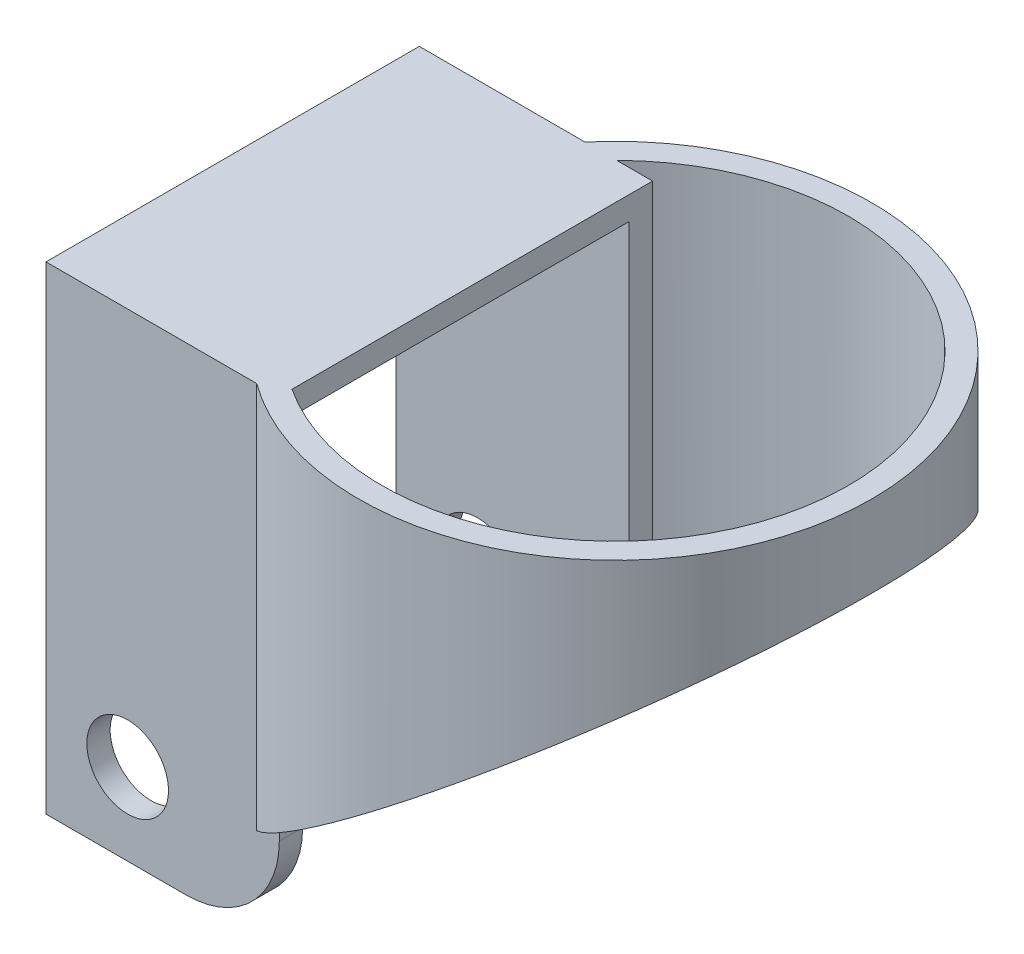
ISO-10303-21;
HEADER;
FILE_DESCRIPTION(('STEP AP214'),'2;1');
FILE_NAME('part.step','',(''),(''),'','','');
FILE_SCHEMA(('AUTOMOTIVE_DESIGN { 1 0 10303 214 1 1 1 1 }'));
ENDSEC;
DATA;
#1=APPLICATION_CONTEXT('core data for automotive mechanical design processes');
#2=APPLICATION_PROTOCOL_DEFINITION('international standard','automotive_design',2000,#1);
#3=PRODUCT_CONTEXT('',#1,'mechanical');
#4=PRODUCT('Part','Part','',(#3));
#5=PRODUCT_RELATED_PRODUCT_CATEGORY('part','',(#4));
#6=PRODUCT_DEFINITION_FORMATION('','',#4);
#7=PRODUCT_DEFINITION_CONTEXT('part definition',#1,'design');
#8=PRODUCT_DEFINITION('design','',#6,#7);
#9=PRODUCT_DEFINITION_SHAPE('','',#8);
#10=(LENGTH_UNIT() NAMED_UNIT(*) SI_UNIT(.MILLI.,.METRE.));
#11=(NAMED_UNIT(*) PLANE_ANGLE_UNIT() SI_UNIT($,.RADIAN.));
#12=(NAMED_UNIT(*) SI_UNIT($,.STERADIAN.) SOLID_ANGLE_UNIT());
#13=UNCERTAINTY_MEASURE_WITH_UNIT(LENGTH_MEASURE(1.E-05),#10,'distance_accuracy_value','');
#14=(GEOMETRIC_REPRESENTATION_CONTEXT(3) GLOBAL_UNCERTAINTY_ASSIGNED_CONTEXT((#13)) GLOBAL_UNIT_ASSIGNED_CONTEXT((#10,
#11,#12)) REPRESENTATION_CONTEXT('',''));
#15=CARTESIAN_POINT('',(0.,0.,0.));
#16=DIRECTION('',(0.,0.,1.));
#17=DIRECTION('',(1.,0.,0.));
#18=AXIS2_PLACEMENT_3D('',#15,#16,#17);
#19=CARTESIAN_POINT('',(0.,40.,0.));
#20=DIRECTION('',(0.,-1.,0.));
#21=DIRECTION('',(0.,0.,-1.));
#22=AXIS2_PLACEMENT_3D('',#19,#20,#21);
#23=CYLINDRICAL_SURFACE('',#22,22.);
#24=DIRECTION('',(0.,-1.,0.));
#25=VECTOR('',#24,1.);
#26=CARTESIAN_POINT('',(-16.7967752148894,40.,-14.2080379497127));
#27=LINE('',#26,#25);
#28=CARTESIAN_POINT('',(-16.7967752148894,40.,-14.2080379497127));
#29=VERTEX_POINT('',#28);
#30=CARTESIAN_POINT('',(-16.7967752148894,3.90241858883297,-14.2080379497128));
#31=VERTEX_POINT('',#30);
#32=EDGE_CURVE('E212',#29,#31,#27,.T.);
#33=ORIENTED_EDGE('',*,*,#32,.F.);
#34=CARTESIAN_POINT('',(0.,40.,0.));
#35=DIRECTION('',(0.,1.,0.));
#36=DIRECTION('',(0.,0.,1.));
#37=AXIS2_PLACEMENT_3D('',#34,#35,#36);
#38=CIRCLE('',#37,22.);
#39=CARTESIAN_POINT('',(-12.9400960738759,40.,17.7919620502873));
#40=VERTEX_POINT('',#39);
#41=EDGE_CURVE('E220',#40,#29,#38,.T.);
#42=ORIENTED_EDGE('',*,*,#41,.F.);
#43=DIRECTION('',(0.,-1.,0.));
#44=VECTOR('',#43,1.);
#45=CARTESIAN_POINT('',(-12.9400960738759,40.,17.7919620502873));
#46=LINE('',#45,#44);
#47=CARTESIAN_POINT('',(-12.9400960738759,6.79492794459309,17.7919620502873));
#48=VERTEX_POINT('',#47);
#49=EDGE_CURVE('E208',#48,#40,#46,.F.);
#50=ORIENTED_EDGE('',*,*,#49,.F.);
#51=CARTESIAN_POINT('',(0.,16.5,0.));
#52=DIRECTION('',(-0.6,0.8,0.));
#53=DIRECTION('',(-0.8,-0.6,0.));
#54=AXIS2_PLACEMENT_3D('',#51,#52,#53);
#55=ELLIPSE('',#54,27.5,22.);
#56=EDGE_CURVE('E216',#48,#31,#55,.T.);
#57=ORIENTED_EDGE('',*,*,#56,.T.);
#58=EDGE_LOOP('',(#33,#42,#50,#57));
#59=FACE_BOUND('',#58,.T.);
#60=ADVANCED_FACE('F32',(#59),#23,.T.);
#61=CARTESIAN_POINT('',(0.,40.,0.));
#62=DIRECTION('',(0.,-1.,0.));
#63=DIRECTION('',(0.,0.,-1.));
#64=AXIS2_PLACEMENT_3D('',#61,#62,#63);
#65=CYLINDRICAL_SURFACE('',#64,20.);
#66=CARTESIAN_POINT('',(0.,40.,0.));
#67=DIRECTION('',(0.,1.,0.));
#68=DIRECTION('',(0.,0.,1.));
#69=AXIS2_PLACEMENT_3D('',#66,#67,#68);
#70=CIRCLE('',#69,20.);
#71=CARTESIAN_POINT('',(-11.,40.,16.7032930884901));
#72=VERTEX_POINT('',#71);
#73=CARTESIAN_POINT('',(-14.0759247518421,40.,-14.2080379497127));
#74=VERTEX_POINT('',#73);
#75=EDGE_CURVE('E156',#72,#74,#70,.T.);
#76=ORIENTED_EDGE('',*,*,#75,.T.);
#77=DIRECTION('',(0.,-1.,0.));
#78=VECTOR('',#77,1.);
#79=CARTESIAN_POINT('',(-14.0759247518421,40.,-14.2080379497127));
#80=LINE('',#79,#78);
#81=CARTESIAN_POINT('',(-14.0759247518421,5.9430564361184,-14.2080379497128));
#82=VERTEX_POINT('',#81);
#83=EDGE_CURVE('E148',#74,#82,#80,.T.);
#84=ORIENTED_EDGE('',*,*,#83,.T.);
#85=CARTESIAN_POINT('',(0.,16.5,0.));
#86=DIRECTION('',(-0.6,0.8,0.));
#87=DIRECTION('',(-0.8,-0.6,0.));
#88=AXIS2_PLACEMENT_3D('',#85,#86,#87);
#89=ELLIPSE('',#88,25.,20.);
#90=CARTESIAN_POINT('',(-11.,8.25,16.7032930884901));
#91=VERTEX_POINT('',#90);
#92=EDGE_CURVE('E215',#91,#82,#89,.T.);
#93=ORIENTED_EDGE('',*,*,#92,.F.);
#94=DIRECTION('',(0.,-1.,0.));
#95=VECTOR('',#94,1.);
#96=CARTESIAN_POINT('',(-11.,40.,16.7032930884901));
#97=LINE('',#96,#95);
#98=EDGE_CURVE('E206',#91,#72,#97,.F.);
#99=ORIENTED_EDGE('',*,*,#98,.T.);
#100=EDGE_LOOP('',(#76,#84,#93,#99));
#101=FACE_BOUND('',#100,.T.);
#102=ADVANCED_FACE('F286',(#101),#65,.F.);
#103=CARTESIAN_POINT('',(22.,33.,-22.));
#104=DIRECTION('',(-0.6,0.8,0.));
#105=DIRECTION('',(-0.8,-0.6,0.));
#106=AXIS2_PLACEMENT_3D('',#103,#104,#105);
#107=PLANE('',#106);
#108=DIRECTION('',(0.8,0.6,0.));
#109=VECTOR('',#108,1.);
#110=CARTESIAN_POINT('',(22.,33.,-14.2080379497127));
#111=LINE('',#110,#109);
#112=EDGE_CURVE('E231',#31,#82,#111,.T.);
#113=ORIENTED_EDGE('',*,*,#112,.F.);
#114=ORIENTED_EDGE('',*,*,#56,.F.);
#115=DIRECTION('',(-0.8,-0.6,0.));
#116=VECTOR('',#115,1.);
#117=CARTESIAN_POINT('',(22.,33.,17.7919620502873));
#118=LINE('',#117,#116);
#119=CARTESIAN_POINT('',(-11.,8.25,17.7919620502873));
#120=VERTEX_POINT('',#119);
#121=EDGE_CURVE('E228',#120,#48,#118,.T.);
#122=ORIENTED_EDGE('',*,*,#121,.F.);
#123=DIRECTION('',(0.,0.,1.));
#124=VECTOR('',#123,1.);
#125=CARTESIAN_POINT('',(-11.,8.25,-22.));
#126=LINE('',#125,#124);
#127=EDGE_CURVE('E223',#91,#120,#126,.T.);
#128=ORIENTED_EDGE('',*,*,#127,.F.);
#129=ORIENTED_EDGE('',*,*,#92,.T.);
#130=EDGE_LOOP('',(#113,#114,#122,#128,#129));
#131=FACE_BOUND('',#130,.T.);
#132=ADVANCED_FACE('F292',(#131),#107,.F.);
#133=CARTESIAN_POINT('',(0.,40.,0.));
#134=DIRECTION('',(0.,1.,0.));
#135=DIRECTION('',(0.,0.,1.));
#136=AXIS2_PLACEMENT_3D('',#133,#134,#135);
#137=PLANE('',#136);
#138=DIRECTION('',(-1.,0.,0.));
#139=VECTOR('',#138,1.);
#140=CARTESIAN_POINT('',(-11.,40.,-14.2080379497127));
#141=LINE('',#140,#139);
#142=CARTESIAN_POINT('',(-11.,40.,-14.2080379497127));
#143=VERTEX_POINT('',#142);
#144=EDGE_CURVE('E145',#143,#74,#141,.T.);
#145=ORIENTED_EDGE('',*,*,#144,.T.);
#146=ORIENTED_EDGE('',*,*,#75,.F.);
#147=DIRECTION('',(0.,0.,1.));
#148=VECTOR('',#147,1.);
#149=CARTESIAN_POINT('',(-11.,40.,-14.2080379497127));
#150=LINE('',#149,#148);
#151=EDGE_CURVE('E137',#143,#72,#150,.T.);
#152=ORIENTED_EDGE('',*,*,#151,.F.);
#153=EDGE_LOOP('',(#145,#146,#152));
#154=FACE_BOUND('',#153,.T.);
#155=DIRECTION('',(-1.,0.,0.));
#156=VECTOR('',#155,1.);
#157=CARTESIAN_POINT('',(-11.,40.,17.7919620502873));
#158=LINE('',#157,#156);
#159=CARTESIAN_POINT('',(-31.,40.,17.7919620502873));
#160=VERTEX_POINT('',#159);
#161=EDGE_CURVE('E203',#40,#160,#158,.T.);
#162=ORIENTED_EDGE('',*,*,#161,.F.);
#163=ORIENTED_EDGE('',*,*,#41,.T.);
#164=CARTESIAN_POINT('',(-31.,40.,-14.2080379497127));
#165=VERTEX_POINT('',#164);
#166=EDGE_CURVE('E152',#29,#165,#141,.T.);
#167=ORIENTED_EDGE('',*,*,#166,.T.);
#168=DIRECTION('',(0.,0.,1.));
#169=VECTOR('',#168,1.);
#170=CARTESIAN_POINT('',(-31.,40.,-14.2080379497127));
#171=LINE('',#170,#169);
#172=EDGE_CURVE('E177',#165,#160,#171,.T.);
#173=ORIENTED_EDGE('',*,*,#172,.T.);
#174=EDGE_LOOP('',(#162,#163,#167,#173));
#175=FACE_BOUND('',#174,.T.);
#176=ADVANCED_FACE('F154',(#154,#175),#137,.T.);
#177=CARTESIAN_POINT('',(-11.,38.,-12.2080379497127));
#178=DIRECTION('',(0.,1.,0.));
#179=DIRECTION('',(0.,0.,1.));
#180=AXIS2_PLACEMENT_3D('',#177,#178,#179);
#181=PLANE('',#180);
#182=DIRECTION('',(-1.,0.,0.));
#183=VECTOR('',#182,1.);
#184=CARTESIAN_POINT('',(-11.,38.,15.7919620502873));
#185=LINE('',#184,#183);
#186=CARTESIAN_POINT('',(-11.,38.,15.7919620502873));
#187=VERTEX_POINT('',#186);
#188=CARTESIAN_POINT('',(-31.,38.,15.7919620502873));
#189=VERTEX_POINT('',#188);
#190=EDGE_CURVE('E197',#187,#189,#185,.T.);
#191=ORIENTED_EDGE('',*,*,#190,.T.);
#192=DIRECTION('',(0.,0.,-1.));
#193=VECTOR('',#192,1.);
#194=CARTESIAN_POINT('',(-31.,38.,-12.2080379497127));
#195=LINE('',#194,#193);
#196=CARTESIAN_POINT('',(-31.,38.,-12.2080379497127));
#197=VERTEX_POINT('',#196);
#198=EDGE_CURVE('E189',#189,#197,#195,.T.);
#199=ORIENTED_EDGE('',*,*,#198,.T.);
#200=DIRECTION('',(-1.,0.,0.));
#201=VECTOR('',#200,1.);
#202=CARTESIAN_POINT('',(-11.,38.,-12.2080379497127));
#203=LINE('',#202,#201);
#204=CARTESIAN_POINT('',(-11.,38.,-12.2080379497127));
#205=VERTEX_POINT('',#204);
#206=EDGE_CURVE('E195',#205,#197,#203,.T.);
#207=ORIENTED_EDGE('',*,*,#206,.F.);
#208=DIRECTION('',(0.,0.,-1.));
#209=VECTOR('',#208,1.);
#210=CARTESIAN_POINT('',(-11.,38.,-12.2080379497127));
#211=LINE('',#210,#209);
#212=EDGE_CURVE('E164',#187,#205,#211,.T.);
#213=ORIENTED_EDGE('',*,*,#212,.F.);
#214=EDGE_LOOP('',(#191,#199,#207,#213));
#215=FACE_BOUND('',#214,.T.);
#216=ADVANCED_FACE('F274',(#215),#181,.F.);
#217=CARTESIAN_POINT('',(-11.,40.,-14.2080379497127));
#218=DIRECTION('',(0.,0.,1.));
#219=DIRECTION('',(0.,-1.,0.));
#220=AXIS2_PLACEMENT_3D('',#217,#218,#219);
#221=PLANE('',#220);
#222=CARTESIAN_POINT('',(-24.,6.,-14.2080379497128));
#223=DIRECTION('',(0.,0.,1.));
#224=DIRECTION('',(0.,-1.,0.));
#225=AXIS2_PLACEMENT_3D('',#222,#223,#224);
#226=CIRCLE('',#225,3.5);
#227=CARTESIAN_POINT('',(-24.,2.5,-14.2080379497128));
#228=VERTEX_POINT('',#227);
#229=EDGE_CURVE('E174',#228,#228,#226,.T.);
#230=ORIENTED_EDGE('',*,*,#229,.T.);
#231=EDGE_LOOP('',(#230));
#232=FACE_BOUND('',#231,.T.);
#233=DIRECTION('',(0.,1.,0.));
#234=VECTOR('',#233,1.);
#235=CARTESIAN_POINT('',(-11.,40.,-14.2080379497127));
#236=LINE('',#235,#234);
#237=CARTESIAN_POINT('',(-11.,7.,-14.2080379497128));
#238=VERTEX_POINT('',#237);
#239=EDGE_CURVE('E131',#238,#143,#236,.T.);
#240=ORIENTED_EDGE('',*,*,#239,.F.);
#241=CARTESIAN_POINT('',(-19.,7.,-14.2080379497128));
#242=DIRECTION('',(0.,0.,1.));
#243=DIRECTION('',(0.,-1.,0.));
#244=AXIS2_PLACEMENT_3D('',#241,#242,#243);
#245=CIRCLE('',#244,8.);
#246=CARTESIAN_POINT('',(-19.,-1.,-14.2080379497128));
#247=VERTEX_POINT('',#246);
#248=EDGE_CURVE('E54',#238,#247,#245,.F.);
#249=ORIENTED_EDGE('',*,*,#248,.T.);
#250=DIRECTION('',(-1.,0.,0.));
#251=VECTOR('',#250,1.);
#252=CARTESIAN_POINT('',(-11.,-1.,-14.2080379497128));
#253=LINE('',#252,#251);
#254=CARTESIAN_POINT('',(-31.,-1.,-14.2080379497128));
#255=VERTEX_POINT('',#254);
#256=EDGE_CURVE('E151',#247,#255,#253,.T.);
#257=ORIENTED_EDGE('',*,*,#256,.T.);
#258=DIRECTION('',(0.,1.,0.));
#259=VECTOR('',#258,1.);
#260=CARTESIAN_POINT('',(-31.,40.,-14.2080379497127));
#261=LINE('',#260,#259);
#262=EDGE_CURVE('E173',#255,#165,#261,.T.);
#263=ORIENTED_EDGE('',*,*,#262,.T.);
#264=ORIENTED_EDGE('',*,*,#166,.F.);
#265=ORIENTED_EDGE('',*,*,#32,.T.);
#266=ORIENTED_EDGE('',*,*,#112,.T.);
#267=ORIENTED_EDGE('',*,*,#83,.F.);
#268=ORIENTED_EDGE('',*,*,#144,.F.);
#269=EDGE_LOOP('',(#240,#249,#257,#263,#264,#265,#266,#267,#268));
#270=FACE_BOUND('',#269,.T.);
#271=ADVANCED_FACE('F146',(#232,#270),#221,.F.);
#272=CARTESIAN_POINT('',(-11.,40.,17.7919620502873));
#273=DIRECTION('',(0.,0.,-1.));
#274=DIRECTION('',(-1.,0.,0.));
#275=AXIS2_PLACEMENT_3D('',#272,#273,#274);
#276=PLANE('',#275);
#277=CARTESIAN_POINT('',(-24.,6.,17.7919620502873));
#278=DIRECTION('',(0.,0.,-1.));
#279=DIRECTION('',(-1.,0.,0.));
#280=AXIS2_PLACEMENT_3D('',#277,#278,#279);
#281=CIRCLE('',#280,3.5);
#282=CARTESIAN_POINT('',(-27.5,6.,17.7919620502873));
#283=VERTEX_POINT('',#282);
#284=EDGE_CURVE('E335',#283,#283,#281,.T.);
#285=ORIENTED_EDGE('',*,*,#284,.T.);
#286=EDGE_LOOP('',(#285));
#287=FACE_BOUND('',#286,.T.);
#288=DIRECTION('',(-1.,0.,0.));
#289=VECTOR('',#288,1.);
#290=CARTESIAN_POINT('',(-11.,-1.,17.7919620502873));
#291=LINE('',#290,#289);
#292=CARTESIAN_POINT('',(-19.,-1.,17.7919620502873));
#293=VERTEX_POINT('',#292);
#294=CARTESIAN_POINT('',(-31.,-1.,17.7919620502873));
#295=VERTEX_POINT('',#294);
#296=EDGE_CURVE('E201',#293,#295,#291,.T.);
#297=ORIENTED_EDGE('',*,*,#296,.F.);
#298=CARTESIAN_POINT('',(-19.,7.,17.7919620502873));
#299=DIRECTION('',(0.,0.,-1.));
#300=DIRECTION('',(-1.,0.,0.));
#301=AXIS2_PLACEMENT_3D('',#298,#299,#300);
#302=CIRCLE('',#301,8.);
#303=CARTESIAN_POINT('',(-11.,7.,17.7919620502873));
#304=VERTEX_POINT('',#303);
#305=EDGE_CURVE('E245',#293,#304,#302,.F.);
#306=ORIENTED_EDGE('',*,*,#305,.T.);
#307=DIRECTION('',(0.,-1.,0.));
#308=VECTOR('',#307,1.);
#309=CARTESIAN_POINT('',(-11.,40.,17.7919620502873));
#310=LINE('',#309,#308);
#311=EDGE_CURVE('E157',#120,#304,#310,.T.);
#312=ORIENTED_EDGE('',*,*,#311,.F.);
#313=ORIENTED_EDGE('',*,*,#121,.T.);
#314=ORIENTED_EDGE('',*,*,#49,.T.);
#315=ORIENTED_EDGE('',*,*,#161,.T.);
#316=DIRECTION('',(0.,-1.,0.));
#317=VECTOR('',#316,1.);
#318=CARTESIAN_POINT('',(-31.,40.,17.7919620502873));
#319=LINE('',#318,#317);
#320=EDGE_CURVE('E180',#160,#295,#319,.T.);
#321=ORIENTED_EDGE('',*,*,#320,.T.);
#322=EDGE_LOOP('',(#297,#306,#312,#313,#314,#315,#321));
#323=FACE_BOUND('',#322,.T.);
#324=ADVANCED_FACE('F251',(#287,#323),#276,.F.);
#325=CARTESIAN_POINT('',(-11.,38.,15.7919620502873));
#326=DIRECTION('',(0.,0.,1.));
#327=DIRECTION('',(1.,0.,0.));
#328=AXIS2_PLACEMENT_3D('',#325,#326,#327);
#329=PLANE('',#328);
#330=CARTESIAN_POINT('',(-24.,6.,15.7919620502873));
#331=DIRECTION('',(0.,0.,1.));
#332=DIRECTION('',(1.,0.,0.));
#333=AXIS2_PLACEMENT_3D('',#330,#331,#332);
#334=CIRCLE('',#333,3.5);
#335=CARTESIAN_POINT('',(-20.5,6.,15.7919620502873));
#336=VERTEX_POINT('',#335);
#337=EDGE_CURVE('E236',#336,#336,#334,.T.);
#338=ORIENTED_EDGE('',*,*,#337,.T.);
#339=EDGE_LOOP('',(#338));
#340=FACE_BOUND('',#339,.T.);
#341=DIRECTION('',(0.,1.,0.));
#342=VECTOR('',#341,1.);
#343=CARTESIAN_POINT('',(-11.,1.,15.7919620502873));
#344=LINE('',#343,#342);
#345=CARTESIAN_POINT('',(-11.,7.,15.7919620502873));
#346=VERTEX_POINT('',#345);
#347=EDGE_CURVE('E159',#346,#187,#344,.T.);
#348=ORIENTED_EDGE('',*,*,#347,.F.);
#349=CARTESIAN_POINT('',(-19.,7.,15.7919620502873));
#350=DIRECTION('',(0.,0.,1.));
#351=DIRECTION('',(1.,0.,0.));
#352=AXIS2_PLACEMENT_3D('',#349,#350,#351);
#353=CIRCLE('',#352,8.);
#354=CARTESIAN_POINT('',(-19.,-1.,15.7919620502873));
#355=VERTEX_POINT('',#354);
#356=EDGE_CURVE('E241',#346,#355,#353,.F.);
#357=ORIENTED_EDGE('',*,*,#356,.T.);
#358=DIRECTION('',(-1.,0.,0.));
#359=VECTOR('',#358,1.);
#360=CARTESIAN_POINT('',(-11.,-1.,15.7919620502873));
#361=LINE('',#360,#359);
#362=CARTESIAN_POINT('',(-31.,-1.,15.7919620502873));
#363=VERTEX_POINT('',#362);
#364=EDGE_CURVE('E199',#355,#363,#361,.T.);
#365=ORIENTED_EDGE('',*,*,#364,.T.);
#366=DIRECTION('',(0.,1.,0.));
#367=VECTOR('',#366,1.);
#368=CARTESIAN_POINT('',(-31.,38.,15.7919620502873));
#369=LINE('',#368,#367);
#370=EDGE_CURVE('E186',#363,#189,#369,.T.);
#371=ORIENTED_EDGE('',*,*,#370,.T.);
#372=ORIENTED_EDGE('',*,*,#190,.F.);
#373=EDGE_LOOP('',(#348,#357,#365,#371,#372));
#374=FACE_BOUND('',#373,.T.);
#375=ADVANCED_FACE('F259',(#340,#374),#329,.F.);
#376=CARTESIAN_POINT('',(-11.,0.999999999999999,-12.2080379497127));
#377=DIRECTION('',(0.,0.,-1.));
#378=DIRECTION('',(-1.,0.,0.));
#379=AXIS2_PLACEMENT_3D('',#376,#377,#378);
#380=PLANE('',#379);
#381=CARTESIAN_POINT('',(-24.,6.,-12.2080379497128));
#382=DIRECTION('',(0.,0.,-1.));
#383=DIRECTION('',(-1.,0.,0.));
#384=AXIS2_PLACEMENT_3D('',#381,#382,#383);
#385=CIRCLE('',#384,3.5);
#386=CARTESIAN_POINT('',(-27.5,6.,-12.2080379497128));
#387=VERTEX_POINT('',#386);
#388=EDGE_CURVE('E233',#387,#387,#385,.T.);
#389=ORIENTED_EDGE('',*,*,#388,.T.);
#390=EDGE_LOOP('',(#389));
#391=FACE_BOUND('',#390,.T.);
#392=DIRECTION('',(-1.,0.,0.));
#393=VECTOR('',#392,1.);
#394=CARTESIAN_POINT('',(-11.,-1.,-12.2080379497127));
#395=LINE('',#394,#393);
#396=CARTESIAN_POINT('',(-19.,-1.,-12.2080379497127));
#397=VERTEX_POINT('',#396);
#398=CARTESIAN_POINT('',(-31.,-1.,-12.2080379497127));
#399=VERTEX_POINT('',#398);
#400=EDGE_CURVE('E169',#397,#399,#395,.T.);
#401=ORIENTED_EDGE('',*,*,#400,.F.);
#402=CARTESIAN_POINT('',(-19.,7.,-12.2080379497127));
#403=DIRECTION('',(0.,0.,-1.));
#404=DIRECTION('',(-1.,0.,0.));
#405=AXIS2_PLACEMENT_3D('',#402,#403,#404);
#406=CIRCLE('',#405,8.);
#407=CARTESIAN_POINT('',(-11.,7.,-12.2080379497127));
#408=VERTEX_POINT('',#407);
#409=EDGE_CURVE('E11',#397,#408,#406,.F.);
#410=ORIENTED_EDGE('',*,*,#409,.T.);
#411=DIRECTION('',(0.,-1.,0.));
#412=VECTOR('',#411,1.);
#413=CARTESIAN_POINT('',(-11.,38.,-12.2080379497127));
#414=LINE('',#413,#412);
#415=EDGE_CURVE('E167',#205,#408,#414,.T.);
#416=ORIENTED_EDGE('',*,*,#415,.F.);
#417=ORIENTED_EDGE('',*,*,#206,.T.);
#418=DIRECTION('',(0.,-1.,0.));
#419=VECTOR('',#418,1.);
#420=CARTESIAN_POINT('',(-31.,0.999999999999999,-12.2080379497127));
#421=LINE('',#420,#419);
#422=EDGE_CURVE('E141',#197,#399,#421,.T.);
#423=ORIENTED_EDGE('',*,*,#422,.T.);
#424=EDGE_LOOP('',(#401,#410,#416,#417,#423));
#425=FACE_BOUND('',#424,.T.);
#426=ADVANCED_FACE('F277',(#391,#425),#380,.F.);
#427=CARTESIAN_POINT('',(-11.,-1.,-12.2080379497127));
#428=DIRECTION('',(0.,1.,0.));
#429=DIRECTION('',(0.,0.,1.));
#430=AXIS2_PLACEMENT_3D('',#427,#428,#429);
#431=PLANE('',#430);
#432=ORIENTED_EDGE('',*,*,#256,.F.);
#433=DIRECTION('',(0.,0.,-1.));
#434=VECTOR('',#433,1.);
#435=CARTESIAN_POINT('',(-19.,-1.,-12.2080379497127));
#436=LINE('',#435,#434);
#437=EDGE_CURVE('E40',#247,#397,#436,.F.);
#438=ORIENTED_EDGE('',*,*,#437,.T.);
#439=ORIENTED_EDGE('',*,*,#400,.T.);
#440=DIRECTION('',(0.,0.,-1.));
#441=VECTOR('',#440,1.);
#442=CARTESIAN_POINT('',(-31.,-1.,-12.2080379497127));
#443=LINE('',#442,#441);
#444=EDGE_CURVE('E170',#399,#255,#443,.T.);
#445=ORIENTED_EDGE('',*,*,#444,.T.);
#446=EDGE_LOOP('',(#432,#438,#439,#445));
#447=FACE_BOUND('',#446,.T.);
#448=ADVANCED_FACE('F301',(#447),#431,.F.);
#449=CARTESIAN_POINT('',(-11.,-1.,17.7919620502873));
#450=DIRECTION('',(0.,1.,0.));
#451=DIRECTION('',(0.,0.,1.));
#452=AXIS2_PLACEMENT_3D('',#449,#450,#451);
#453=PLANE('',#452);
#454=ORIENTED_EDGE('',*,*,#364,.F.);
#455=DIRECTION('',(0.,0.,-1.));
#456=VECTOR('',#455,1.);
#457=CARTESIAN_POINT('',(-19.,-1.,17.7919620502873));
#458=LINE('',#457,#456);
#459=EDGE_CURVE('E243',#355,#293,#458,.F.);
#460=ORIENTED_EDGE('',*,*,#459,.T.);
#461=ORIENTED_EDGE('',*,*,#296,.T.);
#462=DIRECTION('',(0.,0.,-1.));
#463=VECTOR('',#462,1.);
#464=CARTESIAN_POINT('',(-31.,-1.,17.7919620502873));
#465=LINE('',#464,#463);
#466=EDGE_CURVE('E183',#295,#363,#465,.T.);
#467=ORIENTED_EDGE('',*,*,#466,.T.);
#468=EDGE_LOOP('',(#454,#460,#461,#467));
#469=FACE_BOUND('',#468,.T.);
#470=ADVANCED_FACE('F263',(#469),#453,.F.);
#471=CARTESIAN_POINT('',(-11.,0.,0.));
#472=DIRECTION('',(-1.,0.,0.));
#473=DIRECTION('',(0.,0.,1.));
#474=AXIS2_PLACEMENT_3D('',#471,#472,#473);
#475=PLANE('',#474);
#476=ORIENTED_EDGE('',*,*,#311,.T.);
#477=DIRECTION('',(0.,0.,-1.));
#478=VECTOR('',#477,1.);
#479=CARTESIAN_POINT('',(-11.,7.,0.));
#480=LINE('',#479,#478);
#481=EDGE_CURVE('E238',#304,#346,#480,.T.);
#482=ORIENTED_EDGE('',*,*,#481,.T.);
#483=ORIENTED_EDGE('',*,*,#347,.T.);
#484=ORIENTED_EDGE('',*,*,#212,.T.);
#485=ORIENTED_EDGE('',*,*,#415,.T.);
#486=DIRECTION('',(0.,0.,-1.));
#487=VECTOR('',#486,1.);
#488=CARTESIAN_POINT('',(-11.,7.,0.));
#489=LINE('',#488,#487);
#490=EDGE_CURVE('E140',#408,#238,#489,.T.);
#491=ORIENTED_EDGE('',*,*,#490,.T.);
#492=ORIENTED_EDGE('',*,*,#239,.T.);
#493=ORIENTED_EDGE('',*,*,#151,.T.);
#494=ORIENTED_EDGE('',*,*,#98,.F.);
#495=ORIENTED_EDGE('',*,*,#127,.T.);
#496=EDGE_LOOP('',(#476,#482,#483,#484,#485,#491,#492,#493,#494,#495));
#497=FACE_BOUND('',#496,.T.);
#498=ADVANCED_FACE('F134',(#497),#475,.F.);
#499=CARTESIAN_POINT('',(-31.,0.,0.));
#500=DIRECTION('',(-1.,0.,0.));
#501=DIRECTION('',(0.,0.,1.));
#502=AXIS2_PLACEMENT_3D('',#499,#500,#501);
#503=PLANE('',#502);
#504=ORIENTED_EDGE('',*,*,#444,.F.);
#505=ORIENTED_EDGE('',*,*,#422,.F.);
#506=ORIENTED_EDGE('',*,*,#198,.F.);
#507=ORIENTED_EDGE('',*,*,#370,.F.);
#508=ORIENTED_EDGE('',*,*,#466,.F.);
#509=ORIENTED_EDGE('',*,*,#320,.F.);
#510=ORIENTED_EDGE('',*,*,#172,.F.);
#511=ORIENTED_EDGE('',*,*,#262,.F.);
#512=EDGE_LOOP('',(#504,#505,#506,#507,#508,#509,#510,#511));
#513=FACE_BOUND('',#512,.T.);
#514=ADVANCED_FACE('F268',(#513),#503,.T.);
#515=CARTESIAN_POINT('',(-24.,6.,22.));
#516=DIRECTION('',(0.,0.,-1.));
#517=DIRECTION('',(0.,1.,0.));
#518=AXIS2_PLACEMENT_3D('',#515,#516,#517);
#519=CYLINDRICAL_SURFACE('',#518,3.5);
#520=ORIENTED_EDGE('',*,*,#388,.F.);
#521=EDGE_LOOP('',(#520));
#522=FACE_BOUND('',#521,.T.);
#523=ORIENTED_EDGE('',*,*,#229,.F.);
#524=EDGE_LOOP('',(#523));
#525=FACE_BOUND('',#524,.T.);
#526=ADVANCED_FACE('F322',(#522,#525),#519,.F.);
#527=ORIENTED_EDGE('',*,*,#337,.F.);
#528=EDGE_LOOP('',(#527));
#529=FACE_BOUND('',#528,.T.);
#530=ORIENTED_EDGE('',*,*,#284,.F.);
#531=EDGE_LOOP('',(#530));
#532=FACE_BOUND('',#531,.T.);
#533=ADVANCED_FACE('F284',(#529,#532),#519,.F.);
#534=CARTESIAN_POINT('',(-19.,7.,0.));
#535=DIRECTION('',(0.,0.,-1.));
#536=DIRECTION('',(-1.,0.,0.));
#537=AXIS2_PLACEMENT_3D('',#534,#535,#536);
#538=CYLINDRICAL_SURFACE('',#537,8.);
#539=ORIENTED_EDGE('',*,*,#305,.F.);
#540=ORIENTED_EDGE('',*,*,#459,.F.);
#541=ORIENTED_EDGE('',*,*,#356,.F.);
#542=ORIENTED_EDGE('',*,*,#481,.F.);
#543=EDGE_LOOP('',(#539,#540,#541,#542));
#544=FACE_BOUND('',#543,.T.);
#545=ADVANCED_FACE('F256',(#544),#538,.T.);
#546=CARTESIAN_POINT('',(-19.,7.,0.));
#547=DIRECTION('',(0.,0.,-1.));
#548=DIRECTION('',(-1.,0.,0.));
#549=AXIS2_PLACEMENT_3D('',#546,#547,#548);
#550=CYLINDRICAL_SURFACE('',#549,8.);
#551=ORIENTED_EDGE('',*,*,#409,.F.);
#552=ORIENTED_EDGE('',*,*,#437,.F.);
#553=ORIENTED_EDGE('',*,*,#248,.F.);
#554=ORIENTED_EDGE('',*,*,#490,.F.);
#555=EDGE_LOOP('',(#551,#552,#553,#554));
#556=FACE_BOUND('',#555,.T.);
#557=ADVANCED_FACE('F34',(#556),#550,.T.);
#558=CLOSED_SHELL('',(#60,#102,#132,#176,#216,#271,#324,#375,#426,#448,#470,#498,#514,#526,#533,
#545,#557));
#559=MANIFOLD_SOLID_BREP('B2',#558);
#560=ADVANCED_BREP_SHAPE_REPRESENTATION('',(#18,#559),#14);
#561=SHAPE_DEFINITION_REPRESENTATION(#9,#560);
ENDSEC;
END-ISO-10303-21;
